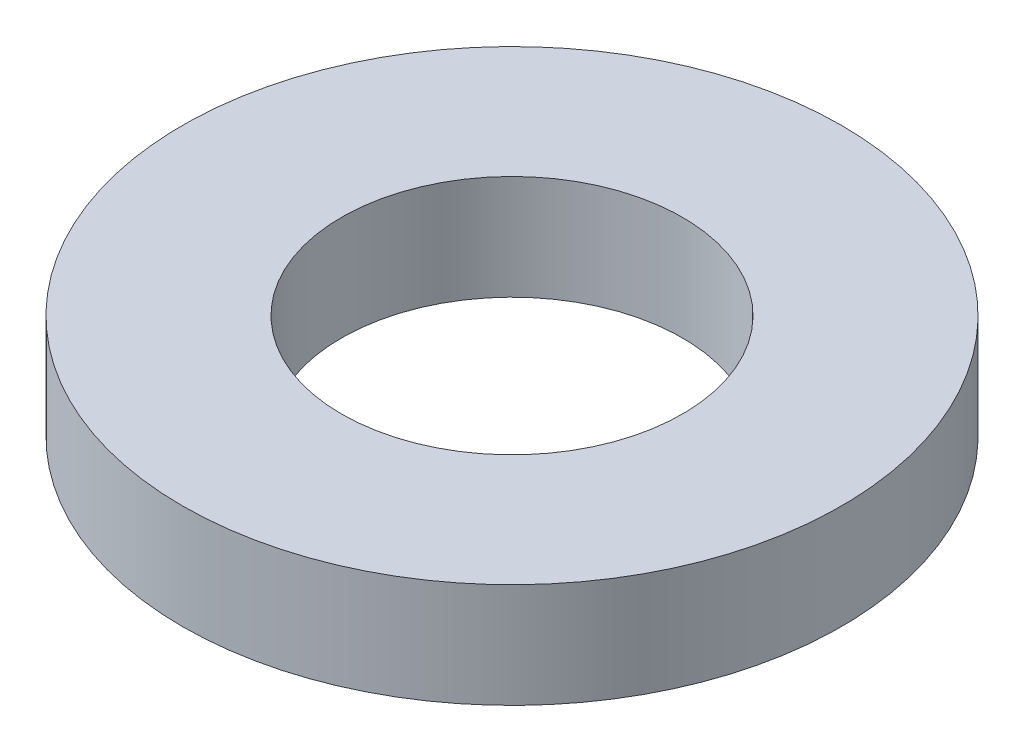
ISO-10303-21;
HEADER;
FILE_DESCRIPTION(('STEP AP214'),'2;1');
FILE_NAME('part.step','',(''),(''),'','','');
FILE_SCHEMA(('AUTOMOTIVE_DESIGN { 1 0 10303 214 1 1 1 1 }'));
ENDSEC;
DATA;
#1=APPLICATION_CONTEXT('core data for automotive mechanical design processes');
#2=APPLICATION_PROTOCOL_DEFINITION('international standard','automotive_design',2000,#1);
#3=PRODUCT_CONTEXT('',#1,'mechanical');
#4=PRODUCT('Part','Part','',(#3));
#5=PRODUCT_RELATED_PRODUCT_CATEGORY('part','',(#4));
#6=PRODUCT_DEFINITION_FORMATION('','',#4);
#7=PRODUCT_DEFINITION_CONTEXT('part definition',#1,'design');
#8=PRODUCT_DEFINITION('design','',#6,#7);
#9=PRODUCT_DEFINITION_SHAPE('','',#8);
#10=(LENGTH_UNIT() NAMED_UNIT(*) SI_UNIT(.MILLI.,.METRE.));
#11=(NAMED_UNIT(*) PLANE_ANGLE_UNIT() SI_UNIT($,.RADIAN.));
#12=(NAMED_UNIT(*) SI_UNIT($,.STERADIAN.) SOLID_ANGLE_UNIT());
#13=UNCERTAINTY_MEASURE_WITH_UNIT(LENGTH_MEASURE(1.E-05),#10,'distance_accuracy_value','');
#14=(GEOMETRIC_REPRESENTATION_CONTEXT(3) GLOBAL_UNCERTAINTY_ASSIGNED_CONTEXT((#13)) GLOBAL_UNIT_ASSIGNED_CONTEXT((#10,
#11,#12)) REPRESENTATION_CONTEXT('',''));
#15=CARTESIAN_POINT('',(0.,0.,0.));
#16=DIRECTION('',(0.,0.,1.));
#17=DIRECTION('',(1.,0.,0.));
#18=AXIS2_PLACEMENT_3D('',#15,#16,#17);
#19=CARTESIAN_POINT('',(0.,23.,0.));
#20=DIRECTION('',(0.,-1.,0.));
#21=DIRECTION('',(0.,0.,-1.));
#22=AXIS2_PLACEMENT_3D('',#19,#20,#21);
#23=CYLINDRICAL_SURFACE('',#22,72.5);
#24=CARTESIAN_POINT('',(0.,23.,0.));
#25=DIRECTION('',(0.,1.,0.));
#26=DIRECTION('',(0.,0.,1.));
#27=AXIS2_PLACEMENT_3D('',#24,#25,#26);
#28=CIRCLE('',#27,72.5);
#29=CARTESIAN_POINT('',(0.,23.,72.5));
#30=VERTEX_POINT('',#29);
#31=EDGE_CURVE('E10',#30,#30,#28,.T.);
#32=ORIENTED_EDGE('',*,*,#31,.F.);
#33=EDGE_LOOP('',(#32));
#34=FACE_BOUND('',#33,.T.);
#35=CARTESIAN_POINT('',(0.,0.,0.));
#36=DIRECTION('',(0.,1.,0.));
#37=DIRECTION('',(0.,0.,1.));
#38=AXIS2_PLACEMENT_3D('',#35,#36,#37);
#39=CIRCLE('',#38,72.5);
#40=CARTESIAN_POINT('',(0.,0.,72.5));
#41=VERTEX_POINT('',#40);
#42=EDGE_CURVE('E37',#41,#41,#39,.T.);
#43=ORIENTED_EDGE('',*,*,#42,.T.);
#44=EDGE_LOOP('',(#43));
#45=FACE_BOUND('',#44,.T.);
#46=ADVANCED_FACE('F40',(#34,#45),#23,.T.);
#47=CARTESIAN_POINT('',(0.,23.,0.));
#48=DIRECTION('',(0.,1.,0.));
#49=DIRECTION('',(0.,0.,1.));
#50=AXIS2_PLACEMENT_3D('',#47,#48,#49);
#51=PLANE('',#50);
#52=CARTESIAN_POINT('',(0.,23.,0.));
#53=DIRECTION('',(0.,1.,0.));
#54=DIRECTION('',(0.,0.,1.));
#55=AXIS2_PLACEMENT_3D('',#52,#53,#54);
#56=CIRCLE('',#55,37.5);
#57=CARTESIAN_POINT('',(0.,23.,37.5));
#58=VERTEX_POINT('',#57);
#59=EDGE_CURVE('E50',#58,#58,#56,.T.);
#60=ORIENTED_EDGE('',*,*,#59,.F.);
#61=EDGE_LOOP('',(#60));
#62=FACE_BOUND('',#61,.T.);
#63=ORIENTED_EDGE('',*,*,#31,.T.);
#64=EDGE_LOOP('',(#63));
#65=FACE_BOUND('',#64,.T.);
#66=ADVANCED_FACE('F59',(#62,#65),#51,.T.);
#67=CARTESIAN_POINT('',(0.,0.,0.));
#68=DIRECTION('',(0.,1.,0.));
#69=DIRECTION('',(0.,0.,1.));
#70=AXIS2_PLACEMENT_3D('',#67,#68,#69);
#71=PLANE('',#70);
#72=CARTESIAN_POINT('',(0.,0.,0.));
#73=DIRECTION('',(0.,1.,0.));
#74=DIRECTION('',(0.,0.,1.));
#75=AXIS2_PLACEMENT_3D('',#72,#73,#74);
#76=CIRCLE('',#75,37.5);
#77=CARTESIAN_POINT('',(0.,0.,37.5));
#78=VERTEX_POINT('',#77);
#79=EDGE_CURVE('E47',#78,#78,#76,.T.);
#80=ORIENTED_EDGE('',*,*,#79,.T.);
#81=EDGE_LOOP('',(#80));
#82=FACE_BOUND('',#81,.T.);
#83=ORIENTED_EDGE('',*,*,#42,.F.);
#84=EDGE_LOOP('',(#83));
#85=FACE_BOUND('',#84,.T.);
#86=ADVANCED_FACE('F58',(#82,#85),#71,.F.);
#87=CARTESIAN_POINT('',(0.,23.,0.));
#88=DIRECTION('',(0.,-1.,0.));
#89=DIRECTION('',(0.,0.,-1.));
#90=AXIS2_PLACEMENT_3D('',#87,#88,#89);
#91=CYLINDRICAL_SURFACE('',#90,37.5);
#92=ORIENTED_EDGE('',*,*,#59,.T.);
#93=EDGE_LOOP('',(#92));
#94=FACE_BOUND('',#93,.T.);
#95=ORIENTED_EDGE('',*,*,#79,.F.);
#96=EDGE_LOOP('',(#95));
#97=FACE_BOUND('',#96,.T.);
#98=ADVANCED_FACE('F54',(#94,#97),#91,.F.);
#99=CLOSED_SHELL('',(#46,#66,#86,#98));
#100=MANIFOLD_SOLID_BREP('B2',#99);
#101=ADVANCED_BREP_SHAPE_REPRESENTATION('',(#18,#100),#14);
#102=SHAPE_DEFINITION_REPRESENTATION(#9,#101);
ENDSEC;
END-ISO-10303-21;
